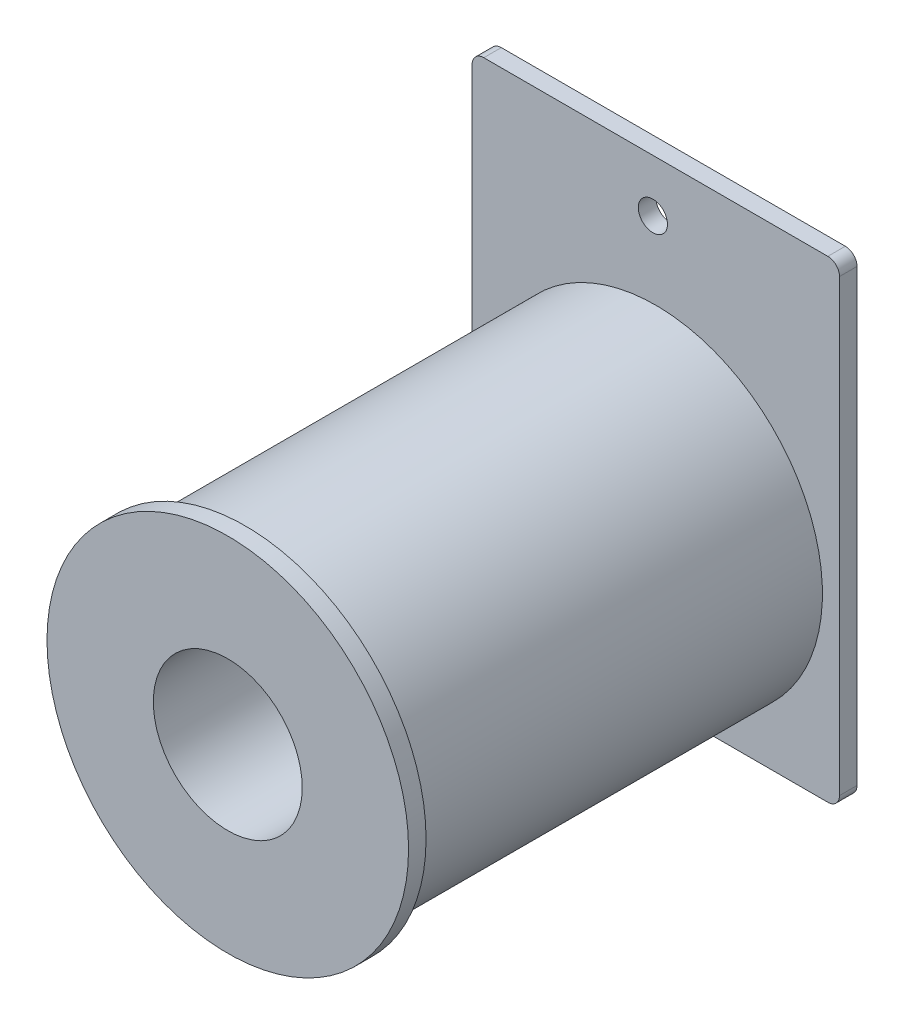
ISO-10303-21;
HEADER;
FILE_DESCRIPTION(('STEP AP214'),'2;1');
FILE_NAME('part.step','',(''),(''),'','','');
FILE_SCHEMA(('AUTOMOTIVE_DESIGN { 1 0 10303 214 1 1 1 1 }'));
ENDSEC;
DATA;
#1=APPLICATION_CONTEXT('core data for automotive mechanical design processes');
#2=APPLICATION_PROTOCOL_DEFINITION('international standard','automotive_design',2000,#1);
#3=PRODUCT_CONTEXT('',#1,'mechanical');
#4=PRODUCT('Part','Part','',(#3));
#5=PRODUCT_RELATED_PRODUCT_CATEGORY('part','',(#4));
#6=PRODUCT_DEFINITION_FORMATION('','',#4);
#7=PRODUCT_DEFINITION_CONTEXT('part definition',#1,'design');
#8=PRODUCT_DEFINITION('design','',#6,#7);
#9=PRODUCT_DEFINITION_SHAPE('','',#8);
#10=(LENGTH_UNIT() NAMED_UNIT(*) SI_UNIT(.MILLI.,.METRE.));
#11=(NAMED_UNIT(*) PLANE_ANGLE_UNIT() SI_UNIT($,.RADIAN.));
#12=(NAMED_UNIT(*) SI_UNIT($,.STERADIAN.) SOLID_ANGLE_UNIT());
#13=UNCERTAINTY_MEASURE_WITH_UNIT(LENGTH_MEASURE(1.E-05),#10,'distance_accuracy_value','');
#14=(GEOMETRIC_REPRESENTATION_CONTEXT(3) GLOBAL_UNCERTAINTY_ASSIGNED_CONTEXT((#13)) GLOBAL_UNIT_ASSIGNED_CONTEXT((#10,
#11,#12)) REPRESENTATION_CONTEXT('',''));
#15=CARTESIAN_POINT('',(0.,0.,0.));
#16=DIRECTION('',(0.,0.,1.));
#17=DIRECTION('',(1.,0.,0.));
#18=AXIS2_PLACEMENT_3D('',#15,#16,#17);
#19=CARTESIAN_POINT('',(0.,0.,35.2));
#20=DIRECTION('',(0.,0.,-1.));
#21=DIRECTION('',(-1.,0.,0.));
#22=AXIS2_PLACEMENT_3D('',#19,#20,#21);
#23=CYLINDRICAL_SURFACE('',#22,14.285);
#24=CARTESIAN_POINT('',(0.,0.,35.2));
#25=DIRECTION('',(0.,0.,1.));
#26=DIRECTION('',(1.,0.,0.));
#27=AXIS2_PLACEMENT_3D('',#24,#25,#26);
#28=CIRCLE('',#27,14.285);
#29=CARTESIAN_POINT('',(14.285,0.,35.2));
#30=VERTEX_POINT('',#29);
#31=EDGE_CURVE('E11',#30,#30,#28,.T.);
#32=ORIENTED_EDGE('',*,*,#31,.F.);
#33=EDGE_LOOP('',(#32));
#34=FACE_BOUND('',#33,.T.);
#35=CARTESIAN_POINT('',(0.,0.,0.));
#36=DIRECTION('',(0.,0.,-1.));
#37=DIRECTION('',(-1.,0.,0.));
#38=AXIS2_PLACEMENT_3D('',#35,#36,#37);
#39=CIRCLE('',#38,14.285);
#40=CARTESIAN_POINT('',(-14.285,0.,0.));
#41=VERTEX_POINT('',#40);
#42=EDGE_CURVE('E166',#41,#41,#39,.T.);
#43=ORIENTED_EDGE('',*,*,#42,.F.);
#44=EDGE_LOOP('',(#43));
#45=FACE_BOUND('',#44,.T.);
#46=ADVANCED_FACE('F34',(#34,#45),#23,.T.);
#47=CARTESIAN_POINT('',(0.,0.,35.2));
#48=DIRECTION('',(0.,0.,1.));
#49=DIRECTION('',(1.,0.,0.));
#50=AXIS2_PLACEMENT_3D('',#47,#48,#49);
#51=PLANE('',#50);
#52=CARTESIAN_POINT('',(0.,0.,35.2));
#53=DIRECTION('',(0.,0.,1.));
#54=DIRECTION('',(1.,0.,0.));
#55=AXIS2_PLACEMENT_3D('',#52,#53,#54);
#56=CIRCLE('',#55,15.5);
#57=CARTESIAN_POINT('',(15.5,0.,35.2));
#58=VERTEX_POINT('',#57);
#59=EDGE_CURVE('E169',#58,#58,#56,.T.);
#60=ORIENTED_EDGE('',*,*,#59,.F.);
#61=EDGE_LOOP('',(#60));
#62=FACE_BOUND('',#61,.T.);
#63=ORIENTED_EDGE('',*,*,#31,.T.);
#64=EDGE_LOOP('',(#63));
#65=FACE_BOUND('',#64,.T.);
#66=ADVANCED_FACE('F176',(#62,#65),#51,.F.);
#67=CARTESIAN_POINT('',(0.,0.,36.7));
#68=DIRECTION('',(0.,0.,-1.));
#69=DIRECTION('',(-1.,0.,0.));
#70=AXIS2_PLACEMENT_3D('',#67,#68,#69);
#71=CYLINDRICAL_SURFACE('',#70,15.5);
#72=CARTESIAN_POINT('',(0.,0.,36.7));
#73=DIRECTION('',(0.,0.,1.));
#74=DIRECTION('',(1.,0.,0.));
#75=AXIS2_PLACEMENT_3D('',#72,#73,#74);
#76=CIRCLE('',#75,15.5);
#77=CARTESIAN_POINT('',(15.5,0.,36.7));
#78=VERTEX_POINT('',#77);
#79=EDGE_CURVE('E42',#78,#78,#76,.T.);
#80=ORIENTED_EDGE('',*,*,#79,.F.);
#81=EDGE_LOOP('',(#80));
#82=FACE_BOUND('',#81,.T.);
#83=ORIENTED_EDGE('',*,*,#59,.T.);
#84=EDGE_LOOP('',(#83));
#85=FACE_BOUND('',#84,.T.);
#86=ADVANCED_FACE('F174',(#82,#85),#71,.T.);
#87=CARTESIAN_POINT('',(0.,0.,36.7));
#88=DIRECTION('',(0.,0.,1.));
#89=DIRECTION('',(1.,0.,0.));
#90=AXIS2_PLACEMENT_3D('',#87,#88,#89);
#91=PLANE('',#90);
#92=CARTESIAN_POINT('',(0.,0.,36.7));
#93=DIRECTION('',(0.,0.,1.));
#94=DIRECTION('',(1.,0.,0.));
#95=AXIS2_PLACEMENT_3D('',#92,#93,#94);
#96=CIRCLE('',#95,6.385);
#97=CARTESIAN_POINT('',(6.385,0.,36.7));
#98=VERTEX_POINT('',#97);
#99=EDGE_CURVE('E284',#98,#98,#96,.T.);
#100=ORIENTED_EDGE('',*,*,#99,.F.);
#101=EDGE_LOOP('',(#100));
#102=FACE_BOUND('',#101,.T.);
#103=ORIENTED_EDGE('',*,*,#79,.T.);
#104=EDGE_LOOP('',(#103));
#105=FACE_BOUND('',#104,.T.);
#106=ADVANCED_FACE('F189',(#102,#105),#91,.T.);
#107=CARTESIAN_POINT('',(14.75,24.285,0.));
#108=DIRECTION('',(0.,0.,-1.));
#109=DIRECTION('',(-1.,0.,0.));
#110=AXIS2_PLACEMENT_3D('',#107,#108,#109);
#111=PLANE('',#110);
#112=CARTESIAN_POINT('',(-0.250000000000004,20.785,0.));
#113=DIRECTION('',(0.,0.,-1.));
#114=DIRECTION('',(-1.,0.,0.));
#115=AXIS2_PLACEMENT_3D('',#112,#113,#114);
#116=CIRCLE('',#115,1.25);
#117=CARTESIAN_POINT('',(-1.5,20.785,0.));
#118=VERTEX_POINT('',#117);
#119=EDGE_CURVE('E283',#118,#118,#116,.T.);
#120=ORIENTED_EDGE('',*,*,#119,.T.);
#121=EDGE_LOOP('',(#120));
#122=FACE_BOUND('',#121,.T.);
#123=CARTESIAN_POINT('',(14.75,24.285,0.));
#124=DIRECTION('',(0.,0.,-1.));
#125=DIRECTION('',(-1.,0.,0.));
#126=AXIS2_PLACEMENT_3D('',#123,#124,#125);
#127=CIRCLE('',#126,1.);
#128=CARTESIAN_POINT('',(14.75,25.285,0.));
#129=VERTEX_POINT('',#128);
#130=CARTESIAN_POINT('',(15.75,24.285,0.));
#131=VERTEX_POINT('',#130);
#132=EDGE_CURVE('E133',#129,#131,#127,.T.);
#133=ORIENTED_EDGE('',*,*,#132,.F.);
#134=DIRECTION('',(-1.,0.,0.));
#135=VECTOR('',#134,1.);
#136=CARTESIAN_POINT('',(14.75,25.285,0.));
#137=LINE('',#136,#135);
#138=CARTESIAN_POINT('',(-14.75,25.285,0.));
#139=VERTEX_POINT('',#138);
#140=EDGE_CURVE('E148',#129,#139,#137,.T.);
#141=ORIENTED_EDGE('',*,*,#140,.T.);
#142=CARTESIAN_POINT('',(-14.75,24.285,0.));
#143=DIRECTION('',(0.,0.,-1.));
#144=DIRECTION('',(-1.,0.,0.));
#145=AXIS2_PLACEMENT_3D('',#142,#143,#144);
#146=CIRCLE('',#145,1.);
#147=CARTESIAN_POINT('',(-15.75,24.285,0.));
#148=VERTEX_POINT('',#147);
#149=EDGE_CURVE('E146',#148,#139,#146,.T.);
#150=ORIENTED_EDGE('',*,*,#149,.F.);
#151=DIRECTION('',(0.,-1.,0.));
#152=VECTOR('',#151,1.);
#153=CARTESIAN_POINT('',(-15.75,24.285,0.));
#154=LINE('',#153,#152);
#155=CARTESIAN_POINT('',(-15.75,-14.255,0.));
#156=VERTEX_POINT('',#155);
#157=EDGE_CURVE('E112',#148,#156,#154,.T.);
#158=ORIENTED_EDGE('',*,*,#157,.T.);
#159=CARTESIAN_POINT('',(-14.75,-14.255,0.));
#160=DIRECTION('',(0.,0.,-1.));
#161=DIRECTION('',(-1.,0.,0.));
#162=AXIS2_PLACEMENT_3D('',#159,#160,#161);
#163=CIRCLE('',#162,1.);
#164=CARTESIAN_POINT('',(-14.75,-15.255,0.));
#165=VERTEX_POINT('',#164);
#166=EDGE_CURVE('E142',#165,#156,#163,.T.);
#167=ORIENTED_EDGE('',*,*,#166,.F.);
#168=DIRECTION('',(-1.,0.,0.));
#169=VECTOR('',#168,1.);
#170=CARTESIAN_POINT('',(14.75,-15.255,0.));
#171=LINE('',#170,#169);
#172=CARTESIAN_POINT('',(14.75,-15.255,0.));
#173=VERTEX_POINT('',#172);
#174=EDGE_CURVE('E140',#173,#165,#171,.T.);
#175=ORIENTED_EDGE('',*,*,#174,.F.);
#176=CARTESIAN_POINT('',(14.75,-14.255,0.));
#177=DIRECTION('',(0.,0.,-1.));
#178=DIRECTION('',(-1.,0.,0.));
#179=AXIS2_PLACEMENT_3D('',#176,#177,#178);
#180=CIRCLE('',#179,1.);
#181=CARTESIAN_POINT('',(15.75,-14.255,0.));
#182=VERTEX_POINT('',#181);
#183=EDGE_CURVE('E138',#182,#173,#180,.T.);
#184=ORIENTED_EDGE('',*,*,#183,.F.);
#185=DIRECTION('',(0.,-1.,0.));
#186=VECTOR('',#185,1.);
#187=CARTESIAN_POINT('',(15.75,24.285,0.));
#188=LINE('',#187,#186);
#189=EDGE_CURVE('E135',#131,#182,#188,.T.);
#190=ORIENTED_EDGE('',*,*,#189,.F.);
#191=EDGE_LOOP('',(#133,#141,#150,#158,#167,#175,#184,#190));
#192=FACE_BOUND('',#191,.T.);
#193=ORIENTED_EDGE('',*,*,#42,.T.);
#194=EDGE_LOOP('',(#193));
#195=FACE_BOUND('',#194,.T.);
#196=ADVANCED_FACE('F186',(#122,#192,#195),#111,.F.);
#197=CARTESIAN_POINT('',(14.75,24.285,-1.5));
#198=DIRECTION('',(0.,0.,1.));
#199=DIRECTION('',(1.,0.,0.));
#200=AXIS2_PLACEMENT_3D('',#197,#198,#199);
#201=CYLINDRICAL_SURFACE('',#200,1.);
#202=ORIENTED_EDGE('',*,*,#132,.T.);
#203=DIRECTION('',(0.,0.,1.));
#204=VECTOR('',#203,1.);
#205=CARTESIAN_POINT('',(15.75,24.285,-1.5));
#206=LINE('',#205,#204);
#207=CARTESIAN_POINT('',(15.75,24.285,-1.5));
#208=VERTEX_POINT('',#207);
#209=EDGE_CURVE('E164',#208,#131,#206,.T.);
#210=ORIENTED_EDGE('',*,*,#209,.F.);
#211=CARTESIAN_POINT('',(14.75,24.285,-1.5));
#212=DIRECTION('',(0.,0.,-1.));
#213=DIRECTION('',(-1.,0.,0.));
#214=AXIS2_PLACEMENT_3D('',#211,#212,#213);
#215=CIRCLE('',#214,1.);
#216=CARTESIAN_POINT('',(14.75,25.285,-1.5));
#217=VERTEX_POINT('',#216);
#218=EDGE_CURVE('E151',#217,#208,#215,.T.);
#219=ORIENTED_EDGE('',*,*,#218,.F.);
#220=DIRECTION('',(0.,0.,1.));
#221=VECTOR('',#220,1.);
#222=CARTESIAN_POINT('',(14.75,25.285,-1.5));
#223=LINE('',#222,#221);
#224=EDGE_CURVE('E50',#217,#129,#223,.T.);
#225=ORIENTED_EDGE('',*,*,#224,.T.);
#226=EDGE_LOOP('',(#202,#210,#219,#225));
#227=FACE_BOUND('',#226,.T.);
#228=ADVANCED_FACE('F188',(#227),#201,.T.);
#229=CARTESIAN_POINT('',(15.75,24.285,-1.5));
#230=DIRECTION('',(-1.,0.,0.));
#231=DIRECTION('',(0.,-1.,0.));
#232=AXIS2_PLACEMENT_3D('',#229,#230,#231);
#233=PLANE('',#232);
#234=ORIENTED_EDGE('',*,*,#189,.T.);
#235=DIRECTION('',(0.,0.,1.));
#236=VECTOR('',#235,1.);
#237=CARTESIAN_POINT('',(15.75,-14.255,-1.5));
#238=LINE('',#237,#236);
#239=CARTESIAN_POINT('',(15.75,-14.255,-1.5));
#240=VERTEX_POINT('',#239);
#241=EDGE_CURVE('E161',#240,#182,#238,.T.);
#242=ORIENTED_EDGE('',*,*,#241,.F.);
#243=DIRECTION('',(0.,-1.,0.));
#244=VECTOR('',#243,1.);
#245=CARTESIAN_POINT('',(15.75,24.285,-1.5));
#246=LINE('',#245,#244);
#247=EDGE_CURVE('E90',#208,#240,#246,.T.);
#248=ORIENTED_EDGE('',*,*,#247,.F.);
#249=ORIENTED_EDGE('',*,*,#209,.T.);
#250=EDGE_LOOP('',(#234,#242,#248,#249));
#251=FACE_BOUND('',#250,.T.);
#252=ADVANCED_FACE('F196',(#251),#233,.F.);
#253=CARTESIAN_POINT('',(14.75,-14.255,-1.5));
#254=DIRECTION('',(0.,0.,1.));
#255=DIRECTION('',(1.,0.,0.));
#256=AXIS2_PLACEMENT_3D('',#253,#254,#255);
#257=CYLINDRICAL_SURFACE('',#256,1.);
#258=ORIENTED_EDGE('',*,*,#183,.T.);
#259=DIRECTION('',(0.,0.,1.));
#260=VECTOR('',#259,1.);
#261=CARTESIAN_POINT('',(14.75,-15.255,-1.5));
#262=LINE('',#261,#260);
#263=CARTESIAN_POINT('',(14.75,-15.255,-1.5));
#264=VERTEX_POINT('',#263);
#265=EDGE_CURVE('E158',#264,#173,#262,.T.);
#266=ORIENTED_EDGE('',*,*,#265,.F.);
#267=CARTESIAN_POINT('',(14.75,-14.255,-1.5));
#268=DIRECTION('',(0.,0.,-1.));
#269=DIRECTION('',(-1.,0.,0.));
#270=AXIS2_PLACEMENT_3D('',#267,#268,#269);
#271=CIRCLE('',#270,1.);
#272=EDGE_CURVE('E294',#240,#264,#271,.T.);
#273=ORIENTED_EDGE('',*,*,#272,.F.);
#274=ORIENTED_EDGE('',*,*,#241,.T.);
#275=EDGE_LOOP('',(#258,#266,#273,#274));
#276=FACE_BOUND('',#275,.T.);
#277=ADVANCED_FACE('F219',(#276),#257,.T.);
#278=CARTESIAN_POINT('',(14.75,-15.255,-1.5));
#279=DIRECTION('',(0.,1.,0.));
#280=DIRECTION('',(0.,0.,1.));
#281=AXIS2_PLACEMENT_3D('',#278,#279,#280);
#282=PLANE('',#281);
#283=ORIENTED_EDGE('',*,*,#174,.T.);
#284=DIRECTION('',(0.,0.,1.));
#285=VECTOR('',#284,1.);
#286=CARTESIAN_POINT('',(-14.75,-15.255,-1.5));
#287=LINE('',#286,#285);
#288=CARTESIAN_POINT('',(-14.75,-15.255,-1.5));
#289=VERTEX_POINT('',#288);
#290=EDGE_CURVE('E155',#289,#165,#287,.T.);
#291=ORIENTED_EDGE('',*,*,#290,.F.);
#292=DIRECTION('',(-1.,0.,0.));
#293=VECTOR('',#292,1.);
#294=CARTESIAN_POINT('',(14.75,-15.255,-1.5));
#295=LINE('',#294,#293);
#296=EDGE_CURVE('E128',#264,#289,#295,.T.);
#297=ORIENTED_EDGE('',*,*,#296,.F.);
#298=ORIENTED_EDGE('',*,*,#265,.T.);
#299=EDGE_LOOP('',(#283,#291,#297,#298));
#300=FACE_BOUND('',#299,.T.);
#301=ADVANCED_FACE('F215',(#300),#282,.F.);
#302=CARTESIAN_POINT('',(-14.75,-14.255,-1.5));
#303=DIRECTION('',(0.,0.,1.));
#304=DIRECTION('',(1.,0.,0.));
#305=AXIS2_PLACEMENT_3D('',#302,#303,#304);
#306=CYLINDRICAL_SURFACE('',#305,1.);
#307=ORIENTED_EDGE('',*,*,#166,.T.);
#308=DIRECTION('',(0.,0.,1.));
#309=VECTOR('',#308,1.);
#310=CARTESIAN_POINT('',(-15.75,-14.255,-1.5));
#311=LINE('',#310,#309);
#312=CARTESIAN_POINT('',(-15.75,-14.255,-1.5));
#313=VERTEX_POINT('',#312);
#314=EDGE_CURVE('E115',#313,#156,#311,.T.);
#315=ORIENTED_EDGE('',*,*,#314,.F.);
#316=CARTESIAN_POINT('',(-14.75,-14.255,-1.5));
#317=DIRECTION('',(0.,0.,-1.));
#318=DIRECTION('',(-1.,0.,0.));
#319=AXIS2_PLACEMENT_3D('',#316,#317,#318);
#320=CIRCLE('',#319,1.);
#321=EDGE_CURVE('E125',#289,#313,#320,.T.);
#322=ORIENTED_EDGE('',*,*,#321,.F.);
#323=ORIENTED_EDGE('',*,*,#290,.T.);
#324=EDGE_LOOP('',(#307,#315,#322,#323));
#325=FACE_BOUND('',#324,.T.);
#326=ADVANCED_FACE('F212',(#325),#306,.T.);
#327=CARTESIAN_POINT('',(-15.75,24.285,-1.5));
#328=DIRECTION('',(-1.,0.,0.));
#329=DIRECTION('',(0.,-1.,0.));
#330=AXIS2_PLACEMENT_3D('',#327,#328,#329);
#331=PLANE('',#330);
#332=ORIENTED_EDGE('',*,*,#157,.F.);
#333=DIRECTION('',(0.,0.,1.));
#334=VECTOR('',#333,1.);
#335=CARTESIAN_POINT('',(-15.75,24.285,-1.5));
#336=LINE('',#335,#334);
#337=CARTESIAN_POINT('',(-15.75,24.285,-1.5));
#338=VERTEX_POINT('',#337);
#339=EDGE_CURVE('E106',#338,#148,#336,.T.);
#340=ORIENTED_EDGE('',*,*,#339,.F.);
#341=DIRECTION('',(0.,-1.,0.));
#342=VECTOR('',#341,1.);
#343=CARTESIAN_POINT('',(-15.75,24.285,-1.5));
#344=LINE('',#343,#342);
#345=EDGE_CURVE('E110',#338,#313,#344,.T.);
#346=ORIENTED_EDGE('',*,*,#345,.T.);
#347=ORIENTED_EDGE('',*,*,#314,.T.);
#348=EDGE_LOOP('',(#332,#340,#346,#347));
#349=FACE_BOUND('',#348,.T.);
#350=ADVANCED_FACE('F108',(#349),#331,.T.);
#351=CARTESIAN_POINT('',(-14.75,24.285,-1.5));
#352=DIRECTION('',(0.,0.,1.));
#353=DIRECTION('',(1.,0.,0.));
#354=AXIS2_PLACEMENT_3D('',#351,#352,#353);
#355=CYLINDRICAL_SURFACE('',#354,1.);
#356=ORIENTED_EDGE('',*,*,#149,.T.);
#357=DIRECTION('',(0.,0.,1.));
#358=VECTOR('',#357,1.);
#359=CARTESIAN_POINT('',(-14.75,25.285,-1.5));
#360=LINE('',#359,#358);
#361=CARTESIAN_POINT('',(-14.75,25.285,-1.5));
#362=VERTEX_POINT('',#361);
#363=EDGE_CURVE('E77',#362,#139,#360,.T.);
#364=ORIENTED_EDGE('',*,*,#363,.F.);
#365=CARTESIAN_POINT('',(-14.75,24.285,-1.5));
#366=DIRECTION('',(0.,0.,-1.));
#367=DIRECTION('',(-1.,0.,0.));
#368=AXIS2_PLACEMENT_3D('',#365,#366,#367);
#369=CIRCLE('',#368,1.);
#370=EDGE_CURVE('E117',#338,#362,#369,.T.);
#371=ORIENTED_EDGE('',*,*,#370,.F.);
#372=ORIENTED_EDGE('',*,*,#339,.T.);
#373=EDGE_LOOP('',(#356,#364,#371,#372));
#374=FACE_BOUND('',#373,.T.);
#375=ADVANCED_FACE('F118',(#374),#355,.T.);
#376=CARTESIAN_POINT('',(14.75,25.285,-1.5));
#377=DIRECTION('',(0.,1.,0.));
#378=DIRECTION('',(0.,0.,1.));
#379=AXIS2_PLACEMENT_3D('',#376,#377,#378);
#380=PLANE('',#379);
#381=ORIENTED_EDGE('',*,*,#140,.F.);
#382=ORIENTED_EDGE('',*,*,#224,.F.);
#383=DIRECTION('',(-1.,0.,0.));
#384=VECTOR('',#383,1.);
#385=CARTESIAN_POINT('',(14.75,25.285,-1.5));
#386=LINE('',#385,#384);
#387=EDGE_CURVE('E121',#217,#362,#386,.T.);
#388=ORIENTED_EDGE('',*,*,#387,.T.);
#389=ORIENTED_EDGE('',*,*,#363,.T.);
#390=EDGE_LOOP('',(#381,#382,#388,#389));
#391=FACE_BOUND('',#390,.T.);
#392=ADVANCED_FACE('F205',(#391),#380,.T.);
#393=CARTESIAN_POINT('',(14.75,24.285,-1.5));
#394=DIRECTION('',(0.,0.,-1.));
#395=DIRECTION('',(-1.,0.,0.));
#396=AXIS2_PLACEMENT_3D('',#393,#394,#395);
#397=PLANE('',#396);
#398=CARTESIAN_POINT('',(-0.250000000000004,20.785,-1.5));
#399=DIRECTION('',(0.,0.,1.));
#400=DIRECTION('',(1.,0.,0.));
#401=AXIS2_PLACEMENT_3D('',#398,#399,#400);
#402=CIRCLE('',#401,1.25);
#403=CARTESIAN_POINT('',(0.999999999999997,20.785,-1.5));
#404=VERTEX_POINT('',#403);
#405=EDGE_CURVE('E281',#404,#404,#402,.T.);
#406=ORIENTED_EDGE('',*,*,#405,.T.);
#407=EDGE_LOOP('',(#406));
#408=FACE_BOUND('',#407,.T.);
#409=CARTESIAN_POINT('',(0.,0.,-1.5));
#410=DIRECTION('',(0.,0.,1.));
#411=DIRECTION('',(1.,0.,0.));
#412=AXIS2_PLACEMENT_3D('',#409,#410,#411);
#413=CIRCLE('',#412,6.385);
#414=CARTESIAN_POINT('',(6.385,0.,-1.5));
#415=VERTEX_POINT('',#414);
#416=EDGE_CURVE('E136',#415,#415,#413,.T.);
#417=ORIENTED_EDGE('',*,*,#416,.T.);
#418=EDGE_LOOP('',(#417));
#419=FACE_BOUND('',#418,.T.);
#420=ORIENTED_EDGE('',*,*,#218,.T.);
#421=ORIENTED_EDGE('',*,*,#247,.T.);
#422=ORIENTED_EDGE('',*,*,#272,.T.);
#423=ORIENTED_EDGE('',*,*,#296,.T.);
#424=ORIENTED_EDGE('',*,*,#321,.T.);
#425=ORIENTED_EDGE('',*,*,#345,.F.);
#426=ORIENTED_EDGE('',*,*,#370,.T.);
#427=ORIENTED_EDGE('',*,*,#387,.F.);
#428=EDGE_LOOP('',(#420,#421,#422,#423,#424,#425,#426,#427));
#429=FACE_BOUND('',#428,.T.);
#430=ADVANCED_FACE('F123',(#408,#419,#429),#397,.T.);
#431=CARTESIAN_POINT('',(0.,0.,-1.5));
#432=DIRECTION('',(0.,0.,1.));
#433=DIRECTION('',(1.,0.,0.));
#434=AXIS2_PLACEMENT_3D('',#431,#432,#433);
#435=CYLINDRICAL_SURFACE('',#434,6.385);
#436=ORIENTED_EDGE('',*,*,#416,.F.);
#437=EDGE_LOOP('',(#436));
#438=FACE_BOUND('',#437,.T.);
#439=ORIENTED_EDGE('',*,*,#99,.T.);
#440=EDGE_LOOP('',(#439));
#441=FACE_BOUND('',#440,.T.);
#442=ADVANCED_FACE('F256',(#438,#441),#435,.F.);
#443=CARTESIAN_POINT('',(-0.250000000000004,20.785,-1.5));
#444=DIRECTION('',(0.,0.,1.));
#445=DIRECTION('',(1.,0.,0.));
#446=AXIS2_PLACEMENT_3D('',#443,#444,#445);
#447=CYLINDRICAL_SURFACE('',#446,1.25);
#448=ORIENTED_EDGE('',*,*,#405,.F.);
#449=EDGE_LOOP('',(#448));
#450=FACE_BOUND('',#449,.T.);
#451=ORIENTED_EDGE('',*,*,#119,.F.);
#452=EDGE_LOOP('',(#451));
#453=FACE_BOUND('',#452,.T.);
#454=ADVANCED_FACE('F265',(#450,#453),#447,.F.);
#455=CLOSED_SHELL('',(#46,#66,#86,#106,#196,#228,#252,#277,#301,#326,#350,#375,#392,#430,#442,#454));
#456=MANIFOLD_SOLID_BREP('B2',#455);
#457=ADVANCED_BREP_SHAPE_REPRESENTATION('',(#18,#456),#14);
#458=SHAPE_DEFINITION_REPRESENTATION(#9,#457);
ENDSEC;
END-ISO-10303-21;
